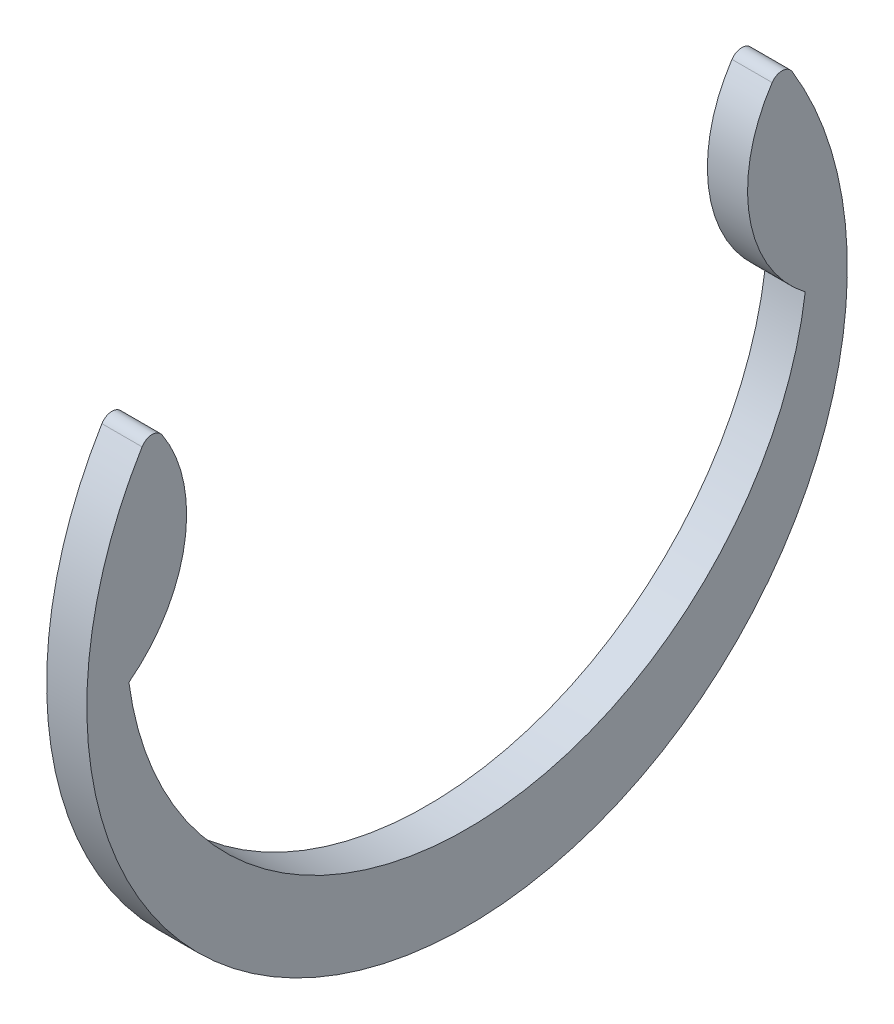
ISO-10303-21;
HEADER;
FILE_DESCRIPTION(('STEP AP214'),'2;1');
FILE_NAME('part.step','',(''),(''),'','','');
FILE_SCHEMA(('AUTOMOTIVE_DESIGN { 1 0 10303 214 1 1 1 1 }'));
ENDSEC;
DATA;
#1=APPLICATION_CONTEXT('core data for automotive mechanical design processes');
#2=APPLICATION_PROTOCOL_DEFINITION('international standard','automotive_design',2000,#1);
#3=PRODUCT_CONTEXT('',#1,'mechanical');
#4=PRODUCT('Part','Part','',(#3));
#5=PRODUCT_RELATED_PRODUCT_CATEGORY('part','',(#4));
#6=PRODUCT_DEFINITION_FORMATION('','',#4);
#7=PRODUCT_DEFINITION_CONTEXT('part definition',#1,'design');
#8=PRODUCT_DEFINITION('design','',#6,#7);
#9=PRODUCT_DEFINITION_SHAPE('','',#8);
#10=(LENGTH_UNIT() NAMED_UNIT(*) SI_UNIT(.MILLI.,.METRE.));
#11=(NAMED_UNIT(*) PLANE_ANGLE_UNIT() SI_UNIT($,.RADIAN.));
#12=(NAMED_UNIT(*) SI_UNIT($,.STERADIAN.) SOLID_ANGLE_UNIT());
#13=UNCERTAINTY_MEASURE_WITH_UNIT(LENGTH_MEASURE(1.E-05),#10,'distance_accuracy_value','');
#14=(GEOMETRIC_REPRESENTATION_CONTEXT(3) GLOBAL_UNCERTAINTY_ASSIGNED_CONTEXT((#13)) GLOBAL_UNIT_ASSIGNED_CONTEXT((#10,
#11,#12)) REPRESENTATION_CONTEXT('',''));
#15=CARTESIAN_POINT('',(0.,0.,0.));
#16=DIRECTION('',(0.,0.,1.));
#17=DIRECTION('',(1.,0.,0.));
#18=AXIS2_PLACEMENT_3D('',#15,#16,#17);
#19=CARTESIAN_POINT('',(-0.533399999999989,2.14558900946491,5.66841071299605));
#20=DIRECTION('',(-1.,0.,0.));
#21=DIRECTION('',(0.,-1.,0.));
#22=AXIS2_PLACEMENT_3D('',#19,#20,#21);
#23=PLANE('',#22);
#24=CARTESIAN_POINT('',(-0.533399999999989,0.,0.));
#25=DIRECTION('',(-1.,0.,0.));
#26=DIRECTION('',(0.,-1.,0.));
#27=AXIS2_PLACEMENT_3D('',#24,#25,#26);
#28=CIRCLE('',#27,10.0965);
#29=CARTESIAN_POINT('',(-0.533399999999989,5.24086666666668,8.62975253597823));
#30=VERTEX_POINT('',#29);
#31=CARTESIAN_POINT('',(-0.533400000000003,5.24086666666668,-8.62975253597823));
#32=VERTEX_POINT('',#31);
#33=EDGE_CURVE('E91',#30,#32,#28,.F.);
#34=ORIENTED_EDGE('',*,*,#33,.F.);
#35=CARTESIAN_POINT('',(-0.533399999999989,5.07785121071208,8.36132688543166));
#36=DIRECTION('',(-1.,0.,0.));
#37=DIRECTION('',(0.,-1.,0.));
#38=AXIS2_PLACEMENT_3D('',#35,#36,#37);
#39=CIRCLE('',#38,0.314048354161319);
#40=CARTESIAN_POINT('',(-0.533399999999989,5.25205704639286,8.10002496127839));
#41=VERTEX_POINT('',#40);
#42=EDGE_CURVE('E81',#41,#30,#39,.F.);
#43=ORIENTED_EDGE('',*,*,#42,.F.);
#44=CARTESIAN_POINT('',(-0.533399999999989,3.09413633880058,11.3368214259921));
#45=DIRECTION('',(-1.,0.,0.));
#46=DIRECTION('',(0.,-1.,0.));
#47=AXIS2_PLACEMENT_3D('',#44,#45,#46);
#48=CIRCLE('',#47,3.89017649139968);
#49=CARTESIAN_POINT('',(-0.533399999999989,0.,8.97890000000003));
#50=VERTEX_POINT('',#49);
#51=EDGE_CURVE('E76',#50,#41,#48,.F.);
#52=ORIENTED_EDGE('',*,*,#51,.F.);
#53=CARTESIAN_POINT('',(-0.533399999999989,1.19704168012925,0.));
#54=DIRECTION('',(-1.,0.,0.));
#55=DIRECTION('',(0.,-1.,0.));
#56=AXIS2_PLACEMENT_3D('',#53,#54,#55);
#57=CIRCLE('',#56,9.05834168012927);
#58=CARTESIAN_POINT('',(-0.533399999999996,0.,-8.97890000000002));
#59=VERTEX_POINT('',#58);
#60=EDGE_CURVE('E20',#50,#59,#57,.F.);
#61=ORIENTED_EDGE('',*,*,#60,.T.);
#62=CARTESIAN_POINT('',(-0.533400000000003,3.09413633880057,-11.3368214259921));
#63=DIRECTION('',(-1.,0.,0.));
#64=DIRECTION('',(0.,-1.,0.));
#65=AXIS2_PLACEMENT_3D('',#62,#63,#64);
#66=CIRCLE('',#65,3.89017649139968);
#67=CARTESIAN_POINT('',(-0.533400000000003,5.25205704639285,-8.10002496127839));
#68=VERTEX_POINT('',#67);
#69=EDGE_CURVE('E96',#68,#59,#66,.F.);
#70=ORIENTED_EDGE('',*,*,#69,.F.);
#71=CARTESIAN_POINT('',(-0.533400000000003,5.07785121071208,-8.36132688543166));
#72=DIRECTION('',(-1.,0.,0.));
#73=DIRECTION('',(0.,-1.,0.));
#74=AXIS2_PLACEMENT_3D('',#71,#72,#73);
#75=CIRCLE('',#74,0.314048354161319);
#76=EDGE_CURVE('E94',#32,#68,#75,.F.);
#77=ORIENTED_EDGE('',*,*,#76,.F.);
#78=EDGE_LOOP('',(#34,#43,#52,#61,#70,#77));
#79=FACE_BOUND('',#78,.T.);
#80=ADVANCED_FACE('F17',(#79),#23,.T.);
#81=CARTESIAN_POINT('',(0.533400000000004,1.19704168012925,0.));
#82=DIRECTION('',(-1.,0.,0.));
#83=DIRECTION('',(0.,-1.,0.));
#84=AXIS2_PLACEMENT_3D('',#81,#82,#83);
#85=CYLINDRICAL_SURFACE('',#84,9.05834168012927);
#86=DIRECTION('',(-1.,0.,0.));
#87=VECTOR('',#86,1.);
#88=CARTESIAN_POINT('',(0.533400000000003,0.,8.97890000000003));
#89=LINE('',#88,#87);
#90=CARTESIAN_POINT('',(0.533400000000003,0.,8.97890000000003));
#91=VERTEX_POINT('',#90);
#92=EDGE_CURVE('E70',#91,#50,#89,.T.);
#93=ORIENTED_EDGE('',*,*,#92,.F.);
#94=CARTESIAN_POINT('',(0.533400000000003,1.19704168012925,0.));
#95=DIRECTION('',(-1.,0.,0.));
#96=DIRECTION('',(0.,-1.,0.));
#97=AXIS2_PLACEMENT_3D('',#94,#95,#96);
#98=CIRCLE('',#97,9.05834168012927);
#99=CARTESIAN_POINT('',(0.533400000000003,0.,-8.97890000000003));
#100=VERTEX_POINT('',#99);
#101=EDGE_CURVE('E78',#91,#100,#98,.F.);
#102=ORIENTED_EDGE('',*,*,#101,.T.);
#103=DIRECTION('',(-1.,0.,0.));
#104=VECTOR('',#103,1.);
#105=CARTESIAN_POINT('',(0.533400000000004,0.,-8.97890000000002));
#106=LINE('',#105,#104);
#107=EDGE_CURVE('E71',#59,#100,#106,.F.);
#108=ORIENTED_EDGE('',*,*,#107,.F.);
#109=ORIENTED_EDGE('',*,*,#60,.F.);
#110=EDGE_LOOP('',(#93,#102,#108,#109));
#111=FACE_BOUND('',#110,.T.);
#112=ADVANCED_FACE('F68',(#111),#85,.F.);
#113=CARTESIAN_POINT('',(0.533400000000004,3.09413633880057,-11.3368214259921));
#114=DIRECTION('',(-1.,0.,0.));
#115=DIRECTION('',(0.,-1.,0.));
#116=AXIS2_PLACEMENT_3D('',#113,#114,#115);
#117=CYLINDRICAL_SURFACE('',#116,3.89017649139968);
#118=DIRECTION('',(-1.,0.,0.));
#119=VECTOR('',#118,1.);
#120=CARTESIAN_POINT('',(0.533400000000004,5.25205704639285,-8.10002496127839));
#121=LINE('',#120,#119);
#122=CARTESIAN_POINT('',(0.533400000000003,5.25205704639285,-8.10002496127839));
#123=VERTEX_POINT('',#122);
#124=EDGE_CURVE('E95',#68,#123,#121,.F.);
#125=ORIENTED_EDGE('',*,*,#124,.F.);
#126=ORIENTED_EDGE('',*,*,#69,.T.);
#127=ORIENTED_EDGE('',*,*,#107,.T.);
#128=CARTESIAN_POINT('',(0.533400000000003,3.09413633880057,-11.3368214259921));
#129=DIRECTION('',(-1.,0.,0.));
#130=DIRECTION('',(0.,-1.,0.));
#131=AXIS2_PLACEMENT_3D('',#128,#129,#130);
#132=CIRCLE('',#131,3.89017649139968);
#133=EDGE_CURVE('E111',#100,#123,#132,.T.);
#134=ORIENTED_EDGE('',*,*,#133,.T.);
#135=EDGE_LOOP('',(#125,#126,#127,#134));
#136=FACE_BOUND('',#135,.T.);
#137=ADVANCED_FACE('F168',(#136),#117,.T.);
#138=CARTESIAN_POINT('',(0.533400000000004,5.07785121071208,-8.36132688543166));
#139=DIRECTION('',(-1.,0.,0.));
#140=DIRECTION('',(0.,-1.,0.));
#141=AXIS2_PLACEMENT_3D('',#138,#139,#140);
#142=CYLINDRICAL_SURFACE('',#141,0.314048354161319);
#143=CARTESIAN_POINT('',(0.533400000000003,5.07785121071208,-8.36132688543166));
#144=DIRECTION('',(-1.,0.,0.));
#145=DIRECTION('',(0.,-1.,0.));
#146=AXIS2_PLACEMENT_3D('',#143,#144,#145);
#147=CIRCLE('',#146,0.314048354161319);
#148=CARTESIAN_POINT('',(0.533400000000003,5.24086666666668,-8.62975253597823));
#149=VERTEX_POINT('',#148);
#150=EDGE_CURVE('E109',#123,#149,#147,.T.);
#151=ORIENTED_EDGE('',*,*,#150,.T.);
#152=DIRECTION('',(-1.,0.,0.));
#153=VECTOR('',#152,1.);
#154=CARTESIAN_POINT('',(0.533400000000003,5.24086666666668,-8.62975253597823));
#155=LINE('',#154,#153);
#156=EDGE_CURVE('E93',#32,#149,#155,.F.);
#157=ORIENTED_EDGE('',*,*,#156,.F.);
#158=ORIENTED_EDGE('',*,*,#76,.T.);
#159=ORIENTED_EDGE('',*,*,#124,.T.);
#160=EDGE_LOOP('',(#151,#157,#158,#159));
#161=FACE_BOUND('',#160,.T.);
#162=ADVANCED_FACE('F120',(#161),#142,.T.);
#163=CARTESIAN_POINT('',(0.533400000000003,0.,0.));
#164=DIRECTION('',(-1.,0.,0.));
#165=DIRECTION('',(0.,-1.,0.));
#166=AXIS2_PLACEMENT_3D('',#163,#164,#165);
#167=CYLINDRICAL_SURFACE('',#166,10.0965);
#168=DIRECTION('',(-1.,0.,0.));
#169=VECTOR('',#168,1.);
#170=CARTESIAN_POINT('',(0.533400000000003,5.24086666666668,8.62975253597823));
#171=LINE('',#170,#169);
#172=CARTESIAN_POINT('',(0.533400000000003,5.24086666666668,8.62975253597823));
#173=VERTEX_POINT('',#172);
#174=EDGE_CURVE('E82',#30,#173,#171,.F.);
#175=ORIENTED_EDGE('',*,*,#174,.F.);
#176=ORIENTED_EDGE('',*,*,#33,.T.);
#177=ORIENTED_EDGE('',*,*,#156,.T.);
#178=CARTESIAN_POINT('',(0.533400000000004,0.,0.));
#179=DIRECTION('',(-1.,0.,0.));
#180=DIRECTION('',(0.,-1.,0.));
#181=AXIS2_PLACEMENT_3D('',#178,#179,#180);
#182=CIRCLE('',#181,10.0965);
#183=EDGE_CURVE('E107',#149,#173,#182,.T.);
#184=ORIENTED_EDGE('',*,*,#183,.T.);
#185=EDGE_LOOP('',(#175,#176,#177,#184));
#186=FACE_BOUND('',#185,.T.);
#187=ADVANCED_FACE('F124',(#186),#167,.T.);
#188=CARTESIAN_POINT('',(0.533400000000003,5.07785121071208,8.36132688543166));
#189=DIRECTION('',(-1.,0.,0.));
#190=DIRECTION('',(0.,-1.,0.));
#191=AXIS2_PLACEMENT_3D('',#188,#189,#190);
#192=CYLINDRICAL_SURFACE('',#191,0.314048354161319);
#193=CARTESIAN_POINT('',(0.533400000000003,5.07785121071208,8.36132688543166));
#194=DIRECTION('',(-1.,0.,0.));
#195=DIRECTION('',(0.,-1.,0.));
#196=AXIS2_PLACEMENT_3D('',#193,#194,#195);
#197=CIRCLE('',#196,0.314048354161319);
#198=CARTESIAN_POINT('',(0.533400000000003,5.25205704639286,8.10002496127839));
#199=VERTEX_POINT('',#198);
#200=EDGE_CURVE('E26',#173,#199,#197,.T.);
#201=ORIENTED_EDGE('',*,*,#200,.T.);
#202=DIRECTION('',(-1.,0.,0.));
#203=VECTOR('',#202,1.);
#204=CARTESIAN_POINT('',(0.533400000000003,5.25205704639286,8.10002496127839));
#205=LINE('',#204,#203);
#206=EDGE_CURVE('E34',#41,#199,#205,.F.);
#207=ORIENTED_EDGE('',*,*,#206,.F.);
#208=ORIENTED_EDGE('',*,*,#42,.T.);
#209=ORIENTED_EDGE('',*,*,#174,.T.);
#210=EDGE_LOOP('',(#201,#207,#208,#209));
#211=FACE_BOUND('',#210,.T.);
#212=ADVANCED_FACE('F126',(#211),#192,.T.);
#213=CARTESIAN_POINT('',(0.533400000000003,3.09413633880058,11.3368214259921));
#214=DIRECTION('',(-1.,0.,0.));
#215=DIRECTION('',(0.,-1.,0.));
#216=AXIS2_PLACEMENT_3D('',#213,#214,#215);
#217=CYLINDRICAL_SURFACE('',#216,3.89017649139968);
#218=CARTESIAN_POINT('',(0.533400000000003,3.09413633880058,11.3368214259921));
#219=DIRECTION('',(-1.,0.,0.));
#220=DIRECTION('',(0.,-1.,0.));
#221=AXIS2_PLACEMENT_3D('',#218,#219,#220);
#222=CIRCLE('',#221,3.89017649139968);
#223=EDGE_CURVE('E11',#199,#91,#222,.T.);
#224=ORIENTED_EDGE('',*,*,#223,.T.);
#225=ORIENTED_EDGE('',*,*,#92,.T.);
#226=ORIENTED_EDGE('',*,*,#51,.T.);
#227=ORIENTED_EDGE('',*,*,#206,.T.);
#228=EDGE_LOOP('',(#224,#225,#226,#227));
#229=FACE_BOUND('',#228,.T.);
#230=ADVANCED_FACE('F75',(#229),#217,.T.);
#231=CARTESIAN_POINT('',(0.533400000000003,2.14558900946491,5.66841071299605));
#232=DIRECTION('',(-1.,0.,0.));
#233=DIRECTION('',(0.,-1.,0.));
#234=AXIS2_PLACEMENT_3D('',#231,#232,#233);
#235=PLANE('',#234);
#236=ORIENTED_EDGE('',*,*,#200,.F.);
#237=ORIENTED_EDGE('',*,*,#183,.F.);
#238=ORIENTED_EDGE('',*,*,#150,.F.);
#239=ORIENTED_EDGE('',*,*,#133,.F.);
#240=ORIENTED_EDGE('',*,*,#101,.F.);
#241=ORIENTED_EDGE('',*,*,#223,.F.);
#242=EDGE_LOOP('',(#236,#237,#238,#239,#240,#241));
#243=FACE_BOUND('',#242,.T.);
#244=ADVANCED_FACE('F115',(#243),#235,.F.);
#245=CLOSED_SHELL('',(#80,#112,#137,#162,#187,#212,#230,#244));
#246=MANIFOLD_SOLID_BREP('B1',#245);
#247=ADVANCED_BREP_SHAPE_REPRESENTATION('',(#18,#246),#14);
#248=SHAPE_DEFINITION_REPRESENTATION(#9,#247);
ENDSEC;
END-ISO-10303-21;
